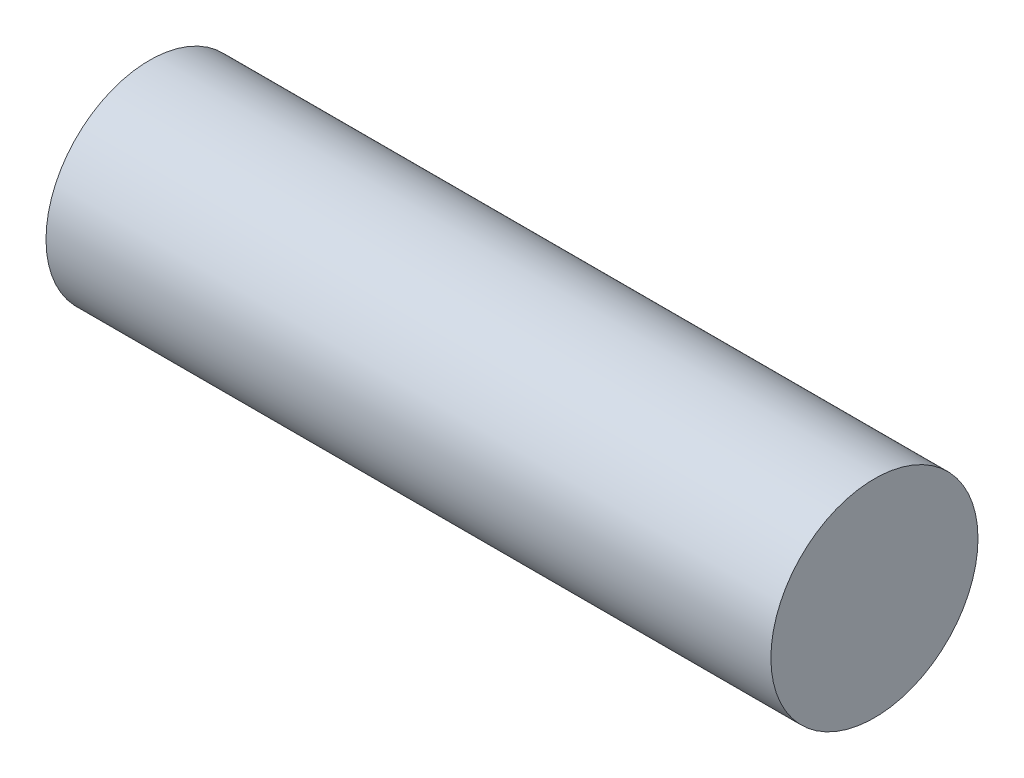
ISO-10303-21;
HEADER;
FILE_DESCRIPTION(('STEP AP214'),'2;1');
FILE_NAME('part.step','',(''),(''),'','','');
FILE_SCHEMA(('AUTOMOTIVE_DESIGN { 1 0 10303 214 1 1 1 1 }'));
ENDSEC;
DATA;
#1=APPLICATION_CONTEXT('core data for automotive mechanical design processes');
#2=APPLICATION_PROTOCOL_DEFINITION('international standard','automotive_design',2000,#1);
#3=PRODUCT_CONTEXT('',#1,'mechanical');
#4=PRODUCT('Part','Part','',(#3));
#5=PRODUCT_RELATED_PRODUCT_CATEGORY('part','',(#4));
#6=PRODUCT_DEFINITION_FORMATION('','',#4);
#7=PRODUCT_DEFINITION_CONTEXT('part definition',#1,'design');
#8=PRODUCT_DEFINITION('design','',#6,#7);
#9=PRODUCT_DEFINITION_SHAPE('','',#8);
#10=(LENGTH_UNIT() NAMED_UNIT(*) SI_UNIT(.MILLI.,.METRE.));
#11=(NAMED_UNIT(*) PLANE_ANGLE_UNIT() SI_UNIT($,.RADIAN.));
#12=(NAMED_UNIT(*) SI_UNIT($,.STERADIAN.) SOLID_ANGLE_UNIT());
#13=UNCERTAINTY_MEASURE_WITH_UNIT(LENGTH_MEASURE(1.E-05),#10,'distance_accuracy_value','');
#14=(GEOMETRIC_REPRESENTATION_CONTEXT(3) GLOBAL_UNCERTAINTY_ASSIGNED_CONTEXT((#13)) GLOBAL_UNIT_ASSIGNED_CONTEXT((#10,
#11,#12)) REPRESENTATION_CONTEXT('',''));
#15=CARTESIAN_POINT('',(0.,0.,0.));
#16=DIRECTION('',(0.,0.,1.));
#17=DIRECTION('',(1.,0.,0.));
#18=AXIS2_PLACEMENT_3D('',#15,#16,#17);
#19=CARTESIAN_POINT('',(44.45,0.,0.));
#20=DIRECTION('',(-1.,0.,0.));
#21=DIRECTION('',(0.,0.,1.));
#22=AXIS2_PLACEMENT_3D('',#19,#20,#21);
#23=CYLINDRICAL_SURFACE('',#22,12.7);
#24=CARTESIAN_POINT('',(44.45,0.,0.));
#25=DIRECTION('',(1.,0.,0.));
#26=DIRECTION('',(0.,0.,-1.));
#27=AXIS2_PLACEMENT_3D('',#24,#25,#26);
#28=CIRCLE('',#27,12.7);
#29=CARTESIAN_POINT('',(44.45,0.,-12.7));
#30=VERTEX_POINT('',#29);
#31=EDGE_CURVE('E10',#30,#30,#28,.T.);
#32=ORIENTED_EDGE('',*,*,#31,.F.);
#33=EDGE_LOOP('',(#32));
#34=FACE_BOUND('',#33,.T.);
#35=CARTESIAN_POINT('',(-44.45,0.,0.));
#36=DIRECTION('',(1.,0.,0.));
#37=DIRECTION('',(0.,0.,-1.));
#38=AXIS2_PLACEMENT_3D('',#35,#36,#37);
#39=CIRCLE('',#38,12.7);
#40=CARTESIAN_POINT('',(-44.45,0.,-12.7));
#41=VERTEX_POINT('',#40);
#42=EDGE_CURVE('E36',#41,#41,#39,.T.);
#43=ORIENTED_EDGE('',*,*,#42,.T.);
#44=EDGE_LOOP('',(#43));
#45=FACE_BOUND('',#44,.T.);
#46=ADVANCED_FACE('F30',(#34,#45),#23,.T.);
#47=CARTESIAN_POINT('',(44.45,0.,0.));
#48=DIRECTION('',(1.,0.,0.));
#49=DIRECTION('',(0.,0.,-1.));
#50=AXIS2_PLACEMENT_3D('',#47,#48,#49);
#51=PLANE('',#50);
#52=ORIENTED_EDGE('',*,*,#31,.T.);
#53=EDGE_LOOP('',(#52));
#54=FACE_BOUND('',#53,.T.);
#55=ADVANCED_FACE('F45',(#54),#51,.T.);
#56=CARTESIAN_POINT('',(-44.45,0.,0.));
#57=DIRECTION('',(1.,0.,0.));
#58=DIRECTION('',(0.,0.,-1.));
#59=AXIS2_PLACEMENT_3D('',#56,#57,#58);
#60=PLANE('',#59);
#61=ORIENTED_EDGE('',*,*,#42,.F.);
#62=EDGE_LOOP('',(#61));
#63=FACE_BOUND('',#62,.T.);
#64=ADVANCED_FACE('F43',(#63),#60,.F.);
#65=CLOSED_SHELL('',(#46,#55,#64));
#66=MANIFOLD_SOLID_BREP('B2',#65);
#67=ADVANCED_BREP_SHAPE_REPRESENTATION('',(#18,#66),#14);
#68=SHAPE_DEFINITION_REPRESENTATION(#9,#67);
ENDSEC;
END-ISO-10303-21;
